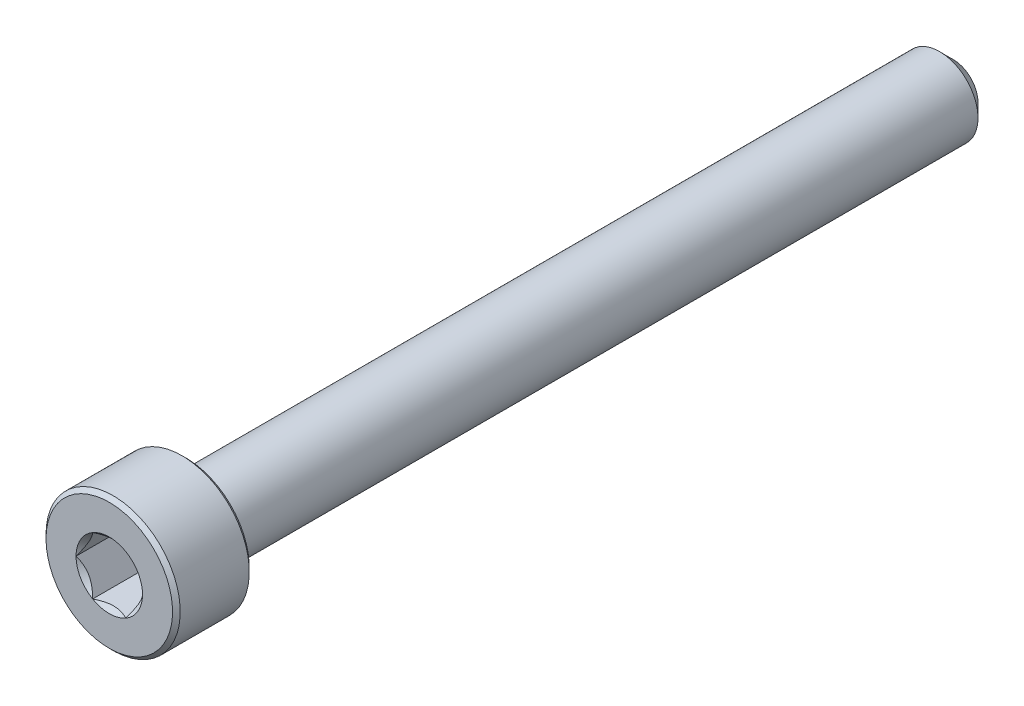
ISO-10303-21;
HEADER;
FILE_DESCRIPTION(('STEP AP214'),'2;1');
FILE_NAME('part.step','',(''),(''),'','','');
FILE_SCHEMA(('AUTOMOTIVE_DESIGN { 1 0 10303 214 1 1 1 1 }'));
ENDSEC;
DATA;
#1=APPLICATION_CONTEXT('core data for automotive mechanical design processes');
#2=APPLICATION_PROTOCOL_DEFINITION('international standard','automotive_design',2000,#1);
#3=PRODUCT_CONTEXT('',#1,'mechanical');
#4=PRODUCT('Part','Part','',(#3));
#5=PRODUCT_RELATED_PRODUCT_CATEGORY('part','',(#4));
#6=PRODUCT_DEFINITION_FORMATION('','',#4);
#7=PRODUCT_DEFINITION_CONTEXT('part definition',#1,'design');
#8=PRODUCT_DEFINITION('design','',#6,#7);
#9=PRODUCT_DEFINITION_SHAPE('','',#8);
#10=(LENGTH_UNIT() NAMED_UNIT(*) SI_UNIT(.MILLI.,.METRE.));
#11=(NAMED_UNIT(*) PLANE_ANGLE_UNIT() SI_UNIT($,.RADIAN.));
#12=(NAMED_UNIT(*) SI_UNIT($,.STERADIAN.) SOLID_ANGLE_UNIT());
#13=UNCERTAINTY_MEASURE_WITH_UNIT(LENGTH_MEASURE(1.E-05),#10,'distance_accuracy_value','');
#14=(GEOMETRIC_REPRESENTATION_CONTEXT(3) GLOBAL_UNCERTAINTY_ASSIGNED_CONTEXT((#13)) GLOBAL_UNIT_ASSIGNED_CONTEXT((#10,
#11,#12)) REPRESENTATION_CONTEXT('',''));
#15=CARTESIAN_POINT('',(0.,0.,0.));
#16=DIRECTION('',(0.,0.,1.));
#17=DIRECTION('',(1.,0.,0.));
#18=AXIS2_PLACEMENT_3D('',#15,#16,#17);
#19=CARTESIAN_POINT('',(0.,0.,22.));
#20=DIRECTION('',(0.,0.,1.));
#21=DIRECTION('',(1.,0.,0.));
#22=AXIS2_PLACEMENT_3D('',#19,#20,#21);
#23=PLANE('',#22);
#24=CARTESIAN_POINT('',(0.,0.,22.));
#25=DIRECTION('',(0.,0.,1.));
#26=DIRECTION('',(1.,0.,0.));
#27=AXIS2_PLACEMENT_3D('',#24,#25,#26);
#28=CIRCLE('',#27,1.73205080756888);
#29=CARTESIAN_POINT('',(1.73205080756888,0.,22.));
#30=VERTEX_POINT('',#29);
#31=CARTESIAN_POINT('',(0.866025403784439,1.5,22.));
#32=VERTEX_POINT('',#31);
#33=EDGE_CURVE('E105',#30,#32,#28,.T.);
#34=ORIENTED_EDGE('',*,*,#33,.F.);
#35=CARTESIAN_POINT('',(0.866025403784438,-1.5,22.));
#36=VERTEX_POINT('',#35);
#37=EDGE_CURVE('E95',#36,#30,#28,.T.);
#38=ORIENTED_EDGE('',*,*,#37,.F.);
#39=CARTESIAN_POINT('',(-0.866025403784438,-1.5,22.));
#40=VERTEX_POINT('',#39);
#41=EDGE_CURVE('E103',#40,#36,#28,.T.);
#42=ORIENTED_EDGE('',*,*,#41,.F.);
#43=CARTESIAN_POINT('',(-1.73205080756888,0.,22.));
#44=VERTEX_POINT('',#43);
#45=EDGE_CURVE('E267',#44,#40,#28,.T.);
#46=ORIENTED_EDGE('',*,*,#45,.F.);
#47=CARTESIAN_POINT('',(-0.866025403784438,1.5,22.));
#48=VERTEX_POINT('',#47);
#49=EDGE_CURVE('E127',#48,#44,#28,.T.);
#50=ORIENTED_EDGE('',*,*,#49,.F.);
#51=EDGE_CURVE('E126',#32,#48,#28,.T.);
#52=ORIENTED_EDGE('',*,*,#51,.F.);
#53=EDGE_LOOP('',(#34,#38,#42,#46,#50,#52));
#54=FACE_BOUND('',#53,.T.);
#55=CARTESIAN_POINT('',(0.,0.,22.));
#56=DIRECTION('',(0.,0.,-1.));
#57=DIRECTION('',(-1.,0.,0.));
#58=AXIS2_PLACEMENT_3D('',#55,#56,#57);
#59=CIRCLE('',#58,3.3);
#60=CARTESIAN_POINT('',(-3.3,0.,22.));
#61=VERTEX_POINT('',#60);
#62=EDGE_CURVE('E49',#61,#61,#59,.T.);
#63=ORIENTED_EDGE('',*,*,#62,.F.);
#64=EDGE_LOOP('',(#63));
#65=FACE_BOUND('',#64,.T.);
#66=ADVANCED_FACE('F36',(#54,#65),#23,.T.);
#67=CARTESIAN_POINT('',(0.,0.,21.8));
#68=DIRECTION('',(0.,0.,-1.));
#69=DIRECTION('',(-1.,0.,0.));
#70=AXIS2_PLACEMENT_3D('',#67,#68,#69);
#71=CONICAL_SURFACE('',#70,3.5,0.78539816339745);
#72=ORIENTED_EDGE('',*,*,#62,.T.);
#73=EDGE_LOOP('',(#72));
#74=FACE_BOUND('',#73,.T.);
#75=CARTESIAN_POINT('',(0.,0.,21.8));
#76=DIRECTION('',(0.,0.,-1.));
#77=DIRECTION('',(-1.,0.,0.));
#78=AXIS2_PLACEMENT_3D('',#75,#76,#77);
#79=CIRCLE('',#78,3.5);
#80=CARTESIAN_POINT('',(-3.5,0.,21.8));
#81=VERTEX_POINT('',#80);
#82=EDGE_CURVE('E221',#81,#81,#79,.T.);
#83=ORIENTED_EDGE('',*,*,#82,.F.);
#84=EDGE_LOOP('',(#83));
#85=FACE_BOUND('',#84,.T.);
#86=ADVANCED_FACE('F209',(#74,#85),#71,.T.);
#87=CARTESIAN_POINT('',(0.,0.,-22.));
#88=DIRECTION('',(0.,0.,-1.));
#89=DIRECTION('',(-1.,0.,0.));
#90=AXIS2_PLACEMENT_3D('',#87,#88,#89);
#91=CYLINDRICAL_SURFACE('',#90,3.5);
#92=ORIENTED_EDGE('',*,*,#82,.T.);
#93=EDGE_LOOP('',(#92));
#94=FACE_BOUND('',#93,.T.);
#95=CARTESIAN_POINT('',(0.,0.,18.2));
#96=DIRECTION('',(0.,0.,-1.));
#97=DIRECTION('',(-1.,0.,0.));
#98=AXIS2_PLACEMENT_3D('',#95,#96,#97);
#99=CIRCLE('',#98,3.5);
#100=CARTESIAN_POINT('',(-3.5,0.,18.2));
#101=VERTEX_POINT('',#100);
#102=EDGE_CURVE('E222',#101,#101,#99,.T.);
#103=ORIENTED_EDGE('',*,*,#102,.F.);
#104=EDGE_LOOP('',(#103));
#105=FACE_BOUND('',#104,.T.);
#106=ADVANCED_FACE('F206',(#94,#105),#91,.T.);
#107=CARTESIAN_POINT('',(0.,0.,18.));
#108=DIRECTION('',(0.,0.,1.));
#109=DIRECTION('',(1.,0.,0.));
#110=AXIS2_PLACEMENT_3D('',#107,#108,#109);
#111=CONICAL_SURFACE('',#110,3.3,0.785398163397454);
#112=ORIENTED_EDGE('',*,*,#102,.T.);
#113=EDGE_LOOP('',(#112));
#114=FACE_BOUND('',#113,.T.);
#115=CARTESIAN_POINT('',(0.,0.,18.));
#116=DIRECTION('',(0.,0.,-1.));
#117=DIRECTION('',(-1.,0.,0.));
#118=AXIS2_PLACEMENT_3D('',#115,#116,#117);
#119=CIRCLE('',#118,3.3);
#120=CARTESIAN_POINT('',(-3.3,0.,18.));
#121=VERTEX_POINT('',#120);
#122=EDGE_CURVE('E225',#121,#121,#119,.T.);
#123=ORIENTED_EDGE('',*,*,#122,.F.);
#124=EDGE_LOOP('',(#123));
#125=FACE_BOUND('',#124,.T.);
#126=ADVANCED_FACE('F202',(#114,#125),#111,.T.);
#127=CARTESIAN_POINT('',(0.,3.3,18.));
#128=DIRECTION('',(0.,0.,-1.));
#129=DIRECTION('',(-1.,0.,0.));
#130=AXIS2_PLACEMENT_3D('',#127,#128,#129);
#131=PLANE('',#130);
#132=ORIENTED_EDGE('',*,*,#122,.T.);
#133=EDGE_LOOP('',(#132));
#134=FACE_BOUND('',#133,.T.);
#135=CARTESIAN_POINT('',(0.,0.,18.));
#136=DIRECTION('',(0.,0.,-1.));
#137=DIRECTION('',(-1.,0.,0.));
#138=AXIS2_PLACEMENT_3D('',#135,#136,#137);
#139=CIRCLE('',#138,2.);
#140=CARTESIAN_POINT('',(-2.,0.,18.));
#141=VERTEX_POINT('',#140);
#142=EDGE_CURVE('E230',#141,#141,#139,.T.);
#143=ORIENTED_EDGE('',*,*,#142,.F.);
#144=EDGE_LOOP('',(#143));
#145=FACE_BOUND('',#144,.T.);
#146=ADVANCED_FACE('F198',(#134,#145),#131,.T.);
#147=CARTESIAN_POINT('',(0.,0.,-22.));
#148=DIRECTION('',(0.,0.,-1.));
#149=DIRECTION('',(-1.,0.,0.));
#150=AXIS2_PLACEMENT_3D('',#147,#148,#149);
#151=CYLINDRICAL_SURFACE('',#150,2.);
#152=ORIENTED_EDGE('',*,*,#142,.T.);
#153=EDGE_LOOP('',(#152));
#154=FACE_BOUND('',#153,.T.);
#155=CARTESIAN_POINT('',(0.,0.,-21.3));
#156=DIRECTION('',(0.,0.,-1.));
#157=DIRECTION('',(-1.,0.,0.));
#158=AXIS2_PLACEMENT_3D('',#155,#156,#157);
#159=CIRCLE('',#158,2.);
#160=CARTESIAN_POINT('',(-2.,0.,-21.3));
#161=VERTEX_POINT('',#160);
#162=EDGE_CURVE('E233',#161,#161,#159,.T.);
#163=ORIENTED_EDGE('',*,*,#162,.F.);
#164=EDGE_LOOP('',(#163));
#165=FACE_BOUND('',#164,.T.);
#166=ADVANCED_FACE('F194',(#154,#165),#151,.T.);
#167=CARTESIAN_POINT('',(0.,0.,-22.));
#168=DIRECTION('',(0.,0.,1.));
#169=DIRECTION('',(1.,0.,0.));
#170=AXIS2_PLACEMENT_3D('',#167,#168,#169);
#171=CONICAL_SURFACE('',#170,1.3,0.78539816339744);
#172=ORIENTED_EDGE('',*,*,#162,.T.);
#173=EDGE_LOOP('',(#172));
#174=FACE_BOUND('',#173,.T.);
#175=CARTESIAN_POINT('',(0.,0.,-22.));
#176=DIRECTION('',(0.,0.,-1.));
#177=DIRECTION('',(-1.,0.,0.));
#178=AXIS2_PLACEMENT_3D('',#175,#176,#177);
#179=CIRCLE('',#178,1.3);
#180=CARTESIAN_POINT('',(-1.3,0.,-22.));
#181=VERTEX_POINT('',#180);
#182=EDGE_CURVE('E236',#181,#181,#179,.T.);
#183=ORIENTED_EDGE('',*,*,#182,.F.);
#184=EDGE_LOOP('',(#183));
#185=FACE_BOUND('',#184,.T.);
#186=ADVANCED_FACE('F190',(#174,#185),#171,.T.);
#187=CARTESIAN_POINT('',(0.,1.3,-22.));
#188=DIRECTION('',(0.,0.,-1.));
#189=DIRECTION('',(-1.,0.,0.));
#190=AXIS2_PLACEMENT_3D('',#187,#188,#189);
#191=PLANE('',#190);
#192=ORIENTED_EDGE('',*,*,#182,.T.);
#193=EDGE_LOOP('',(#192));
#194=FACE_BOUND('',#193,.T.);
#195=ADVANCED_FACE('F187',(#194),#191,.T.);
#196=CARTESIAN_POINT('',(0.,0.,22.));
#197=DIRECTION('',(0.,0.,1.));
#198=DIRECTION('',(1.,0.,0.));
#199=AXIS2_PLACEMENT_3D('',#196,#197,#198);
#200=CONICAL_SURFACE('',#199,1.73205080756888,0.78539816339745);
#201=ORIENTED_EDGE('',*,*,#33,.T.);
#202=CARTESIAN_POINT('',(1.73216627762272,-0.000200000000000874,22.0001154816001));
#203=CARTESIAN_POINT('',(1.70239359975915,0.0513677907370746,21.9703654760673));
#204=CARTESIAN_POINT('',(1.67212305186355,0.1037979176652,21.9423624839103));
#205=CARTESIAN_POINT('',(1.61039789003619,0.210709034055596,21.8910892304401));
#206=CARTESIAN_POINT('',(1.57893740312614,0.265200195814661,21.8678475050444));
#207=CARTESIAN_POINT('',(1.51549879897987,0.375079081357249,21.8280337289922));
#208=CARTESIAN_POINT('',(1.4835368452681,0.4304388090952,21.8113615856709));
#209=CARTESIAN_POINT('',(1.41890915196211,0.542377257477152,21.7856744568181));
#210=CARTESIAN_POINT('',(1.38624538781118,0.59895255655301,21.7766402904789));
#211=CARTESIAN_POINT('',(1.32995210095299,0.696455389516443,21.7684890812268));
#212=CARTESIAN_POINT('',(1.30639533311124,0.737256908280468,21.7672822529892));
#213=CARTESIAN_POINT('',(1.25932335290193,0.81878796961586,21.7693140571623));
#214=CARTESIAN_POINT('',(1.23580815085313,0.859517494314632,21.7725536707483));
#215=CARTESIAN_POINT('',(1.18900414978426,0.940584402163418,21.783291985982));
#216=CARTESIAN_POINT('',(1.16571558211719,0.980921384598291,21.7907946530187));
#217=CARTESIAN_POINT('',(1.11952932016335,1.06091833691403,21.8096516119283));
#218=CARTESIAN_POINT('',(1.09663179808786,1.10057800851621,21.8210075570186));
#219=CARTESIAN_POINT('',(1.03798159809698,1.20216313477449,21.8547216475927));
#220=CARTESIAN_POINT('',(1.00259267147465,1.26345855370969,21.8796218490934));
#221=CARTESIAN_POINT('',(0.950557780604374,1.35358562846331,21.9216566532716));
#222=CARTESIAN_POINT('',(0.933410759677147,1.38328513990772,21.9364251535591));
#223=CARTESIAN_POINT('',(0.899432101996406,1.44213790138375,21.9673105659402));
#224=CARTESIAN_POINT('',(0.88260031928571,1.47129140422064,21.9834268341217));
#225=CARTESIAN_POINT('',(0.865909933730601,1.5002,22.0001154816001));
#226=B_SPLINE_CURVE_WITH_KNOTS('',3,(#202,#203,#204,#205,#206,#207,#208,#209,#210,#211,#212,
#213,#214,#215,#216,#217,#218,#219,#220,#221,#222,#223,#224,#225),.UNSPECIFIED.,.F.,.F.,(4,2,2,
2,2,2,2,2,2,2,2,4),(0.,0.199829143693305,0.40082298738239,0.598623720538183,0.795926240188893,
0.937113067959885,1.07833105577193,1.21968061668222,1.36109089931055,1.58570969637566,
1.69770705470964,1.80965120737194),.UNSPECIFIED.);
#227=EDGE_CURVE('E12',#30,#32,#226,.T.);
#228=ORIENTED_EDGE('',*,*,#227,.F.);
#229=EDGE_LOOP('',(#201,#228));
#230=FACE_BOUND('',#229,.T.);
#231=ADVANCED_FACE('F107',(#230),#200,.F.);
#232=ORIENTED_EDGE('',*,*,#37,.T.);
#233=CARTESIAN_POINT('',(0.8659099337306,-1.5002,22.0001154816001));
#234=CARTESIAN_POINT('',(0.895682611594165,-1.44863220926293,21.9703654760673));
#235=CARTESIAN_POINT('',(0.925953159489764,-1.3962020823348,21.9423624839103));
#236=CARTESIAN_POINT('',(0.987678321317123,-1.2892909659444,21.8910892304401));
#237=CARTESIAN_POINT('',(1.01913880822717,-1.23479980418534,21.8678475050444));
#238=CARTESIAN_POINT('',(1.08257741237344,-1.12492091864275,21.8280337289922));
#239=CARTESIAN_POINT('',(1.11453936608521,-1.0695611909048,21.8113615856709));
#240=CARTESIAN_POINT('',(1.1791670593912,-0.957622742522849,21.7856744568181));
#241=CARTESIAN_POINT('',(1.21183082354213,-0.901047443446991,21.7766402904789));
#242=CARTESIAN_POINT('',(1.26812411040032,-0.803544610483558,21.7684890812268));
#243=CARTESIAN_POINT('',(1.29168087824208,-0.762743091719533,21.7672822529892));
#244=CARTESIAN_POINT('',(1.33875285845138,-0.681212030384141,21.7693140571623));
#245=CARTESIAN_POINT('',(1.36226806050018,-0.640482505685369,21.7725536707483));
#246=CARTESIAN_POINT('',(1.40907206156905,-0.559415597836583,21.783291985982));
#247=CARTESIAN_POINT('',(1.43236062923612,-0.51907861540171,21.7907946530187));
#248=CARTESIAN_POINT('',(1.47854689118997,-0.439081663085968,21.8096516119283));
#249=CARTESIAN_POINT('',(1.50144441326545,-0.399421991483791,21.8210075570186));
#250=CARTESIAN_POINT('',(1.56009461325633,-0.297836865225514,21.8547216475927));
#251=CARTESIAN_POINT('',(1.59548353987866,-0.23654144629031,21.8796218490934));
#252=CARTESIAN_POINT('',(1.64751843074894,-0.146414371536685,21.9216566532716));
#253=CARTESIAN_POINT('',(1.66466545167617,-0.116714860092281,21.9364251535591));
#254=CARTESIAN_POINT('',(1.69864410935691,-0.0578620986162484,21.9673105659402));
#255=CARTESIAN_POINT('',(1.71547589206761,-0.0287085957793627,21.9834268341217));
#256=CARTESIAN_POINT('',(1.73216627762272,0.000199999999999534,22.0001154816001));
#257=B_SPLINE_CURVE_WITH_KNOTS('',3,(#233,#234,#235,#236,#237,#238,#239,#240,#241,#242,#243,
#244,#245,#246,#247,#248,#249,#250,#251,#252,#253,#254,#255,#256),.UNSPECIFIED.,.F.,.F.,(4,2,2,
2,2,2,2,2,2,2,2,4),(0.,0.199829143693305,0.40082298738239,0.598623720538183,0.795926240188891,
0.937113067959884,1.07833105577193,1.21968061668222,1.36109089931055,1.58570969637566,
1.69770705470964,1.80965120737194),.UNSPECIFIED.);
#258=EDGE_CURVE('E98',#36,#30,#257,.T.);
#259=ORIENTED_EDGE('',*,*,#258,.F.);
#260=EDGE_LOOP('',(#232,#259));
#261=FACE_BOUND('',#260,.T.);
#262=ADVANCED_FACE('F97',(#261),#200,.F.);
#263=ORIENTED_EDGE('',*,*,#41,.T.);
#264=CARTESIAN_POINT('',(-1.72720812969692,-1.5,22.5555785162708));
#265=CARTESIAN_POINT('',(-1.68515175699268,-1.5,22.5238299078574));
#266=CARTESIAN_POINT('',(-1.64286104748674,-1.5,22.4923925938074));
#267=CARTESIAN_POINT('',(-1.55771581035942,-1.5,22.4302690875564));
#268=CARTESIAN_POINT('',(-1.51486114386668,-1.5,22.3995830858922));
#269=CARTESIAN_POINT('',(-1.3846813415127,-1.5,22.3084071924272));
#270=CARTESIAN_POINT('',(-1.29637976071654,-1.5,22.2492883434268));
#271=CARTESIAN_POINT('',(-1.11121478730467,-1.5,22.1332309963165));
#272=CARTESIAN_POINT('',(-1.01415038238167,-1.5,22.076609558733));
#273=CARTESIAN_POINT('',(-0.815173408897603,-1.5,21.9730368812657));
#274=CARTESIAN_POINT('',(-0.713278669253283,-1.5,21.9260530415417));
#275=CARTESIAN_POINT('',(-0.56033377494311,-1.5,21.8685726684308));
#276=CARTESIAN_POINT('',(-0.511547982948041,-1.5,21.8520753877572));
#277=CARTESIAN_POINT('',(-0.412798620136866,-1.5,21.822997512927));
#278=CARTESIAN_POINT('',(-0.362834968437562,-1.5,21.810417188594));
#279=CARTESIAN_POINT('',(-0.262863235444983,-1.5,21.7900361941468));
#280=CARTESIAN_POINT('',(-0.212872113808024,-1.5,21.782153632746));
#281=CARTESIAN_POINT('',(-0.112355243569547,-1.5,21.771322063969));
#282=CARTESIAN_POINT('',(-0.0618295883726288,-1.5,21.7683722085243));
#283=CARTESIAN_POINT('',(0.0374291733323832,-1.5,21.7676248577248));
#284=CARTESIAN_POINT('',(0.0861609672002978,-1.5,21.7696447335581));
#285=CARTESIAN_POINT('',(0.183206937768826,-1.5,21.7783225528968));
#286=CARTESIAN_POINT('',(0.231521073438268,-1.5,21.7849809469685));
#287=CARTESIAN_POINT('',(0.328199853425435,-1.5,21.8026852441226));
#288=CARTESIAN_POINT('',(0.376550616310328,-1.5,21.813805811257));
#289=CARTESIAN_POINT('',(0.472195697125598,-1.5,21.8398434140487));
#290=CARTESIAN_POINT('',(0.51949010309274,-1.5,21.8547601320409));
#291=CARTESIAN_POINT('',(0.668391282696623,-1.5,21.9073352235961));
#292=CARTESIAN_POINT('',(0.767878709508551,-1.5,21.950981287472));
#293=CARTESIAN_POINT('',(0.962179866690722,-1.5,22.0480229945931));
#294=CARTESIAN_POINT('',(1.05697519961444,-1.5,22.1014536650895));
#295=CARTESIAN_POINT('',(1.23814273533383,-1.5,22.2116858520046));
#296=CARTESIAN_POINT('',(1.32469942181289,-1.5,22.2681879206986));
#297=CARTESIAN_POINT('',(1.45222331290673,-1.5,22.3555343015787));
#298=CARTESIAN_POINT('',(1.49418091978756,-1.5,22.38495775868));
#299=CARTESIAN_POINT('',(1.57752272931476,-1.5,22.4445828218305));
#300=CARTESIAN_POINT('',(1.61890708647354,-1.5,22.4747842116644));
#301=CARTESIAN_POINT('',(1.66005278019494,-1.5,22.5053081786095));
#302=B_SPLINE_CURVE_WITH_KNOTS('',3,(#264,#265,#266,#267,#268,#269,#270,#271,#272,#273,#274,
#275,#276,#277,#278,#279,#280,#281,#282,#283,#284,#285,#286,#287,#288,#289,#290,#291,#292,#293,
#294,#295,#296,#297,#298,#299,#300,#301),.UNSPECIFIED.,.F.,.F.,(4,2,2,2,2,2,2,2,2,2,2,2,2,2,2,2,
2,2,4),(0.,0.158079548982667,0.31619878099394,0.634850417346958,0.97169031136151,
1.30737131660667,1.46173961127089,1.61611853740677,1.76772101421409,1.91929742368538,
2.065387412096,2.21149159305544,2.36014984633872,2.50879566386709,2.83376031422673,
3.15991186985651,3.46985601802197,3.62358896039973,3.7772796264207),.UNSPECIFIED.);
#303=EDGE_CURVE('E116',#40,#36,#302,.T.);
#304=ORIENTED_EDGE('',*,*,#303,.F.);
#305=EDGE_LOOP('',(#263,#304));
#306=FACE_BOUND('',#305,.T.);
#307=ADVANCED_FACE('F273',(#306),#200,.F.);
#308=ORIENTED_EDGE('',*,*,#45,.T.);
#309=CARTESIAN_POINT('',(-1.73216627762272,0.000200000000000134,22.0001154816001));
#310=CARTESIAN_POINT('',(-1.70239359975915,-0.0513677907370754,21.9703654760673));
#311=CARTESIAN_POINT('',(-1.67212305186355,-0.103797917665201,21.9423624839103));
#312=CARTESIAN_POINT('',(-1.61039789003619,-0.210709034055597,21.8910892304401));
#313=CARTESIAN_POINT('',(-1.57893740312614,-0.265200195814662,21.8678475050444));
#314=CARTESIAN_POINT('',(-1.51549879897987,-0.37507908135725,21.8280337289922));
#315=CARTESIAN_POINT('',(-1.4835368452681,-0.430438809095201,21.8113615856709));
#316=CARTESIAN_POINT('',(-1.41890915196211,-0.542377257477152,21.7856744568181));
#317=CARTESIAN_POINT('',(-1.38624538781118,-0.59895255655301,21.7766402904789));
#318=CARTESIAN_POINT('',(-1.32995210095299,-0.696455389516442,21.7684890812268));
#319=CARTESIAN_POINT('',(-1.30639533311124,-0.737256908280468,21.7672822529892));
#320=CARTESIAN_POINT('',(-1.25932335290193,-0.818787969615859,21.7693140571623));
#321=CARTESIAN_POINT('',(-1.23580815085313,-0.859517494314631,21.7725536707483));
#322=CARTESIAN_POINT('',(-1.18900414978427,-0.940584402163417,21.783291985982));
#323=CARTESIAN_POINT('',(-1.16571558211719,-0.98092138459829,21.7907946530187));
#324=CARTESIAN_POINT('',(-1.11952932016335,-1.06091833691403,21.8096516119283));
#325=CARTESIAN_POINT('',(-1.09663179808786,-1.10057800851621,21.8210075570186));
#326=CARTESIAN_POINT('',(-1.03798159809698,-1.20216313477449,21.8547216475927));
#327=CARTESIAN_POINT('',(-1.00259267147465,-1.26345855370969,21.8796218490934));
#328=CARTESIAN_POINT('',(-0.950557780604374,-1.35358562846332,21.9216566532716));
#329=CARTESIAN_POINT('',(-0.933410759677147,-1.38328513990772,21.9364251535591));
#330=CARTESIAN_POINT('',(-0.899432101996406,-1.44213790138375,21.9673105659402));
#331=CARTESIAN_POINT('',(-0.88260031928571,-1.47129140422064,21.9834268341217));
#332=CARTESIAN_POINT('',(-0.865909933730601,-1.5002,22.0001154816001));
#333=B_SPLINE_CURVE_WITH_KNOTS('',3,(#309,#310,#311,#312,#313,#314,#315,#316,#317,#318,#319,
#320,#321,#322,#323,#324,#325,#326,#327,#328,#329,#330,#331,#332),.UNSPECIFIED.,.F.,.F.,(4,2,2,
2,2,2,2,2,2,2,2,4),(0.,0.199829143693306,0.40082298738239,0.598623720538183,0.795926240188891,
0.937113067959883,1.07833105577193,1.21968061668222,1.36109089931055,1.58570969637566,
1.69770705470964,1.80965120737194),.UNSPECIFIED.);
#334=EDGE_CURVE('E153',#44,#40,#333,.T.);
#335=ORIENTED_EDGE('',*,*,#334,.F.);
#336=EDGE_LOOP('',(#308,#335));
#337=FACE_BOUND('',#336,.T.);
#338=ADVANCED_FACE('F306',(#337),#200,.F.);
#339=ORIENTED_EDGE('',*,*,#49,.T.);
#340=CARTESIAN_POINT('',(-0.865909933730601,1.5002,22.0001154816001));
#341=CARTESIAN_POINT('',(-0.895682611594165,1.44863220926292,21.9703654760673));
#342=CARTESIAN_POINT('',(-0.925953159489764,1.3962020823348,21.9423624839103));
#343=CARTESIAN_POINT('',(-0.987678321317123,1.2892909659444,21.8910892304401));
#344=CARTESIAN_POINT('',(-1.01913880822717,1.23479980418534,21.8678475050444));
#345=CARTESIAN_POINT('',(-1.08257741237344,1.12492091864275,21.8280337289922));
#346=CARTESIAN_POINT('',(-1.11453936608521,1.0695611909048,21.8113615856709));
#347=CARTESIAN_POINT('',(-1.1791670593912,0.957622742522848,21.7856744568181));
#348=CARTESIAN_POINT('',(-1.21183082354213,0.90104744344699,21.7766402904789));
#349=CARTESIAN_POINT('',(-1.26812411040032,0.803544610483558,21.7684890812268));
#350=CARTESIAN_POINT('',(-1.29168087824208,0.762743091719533,21.7672822529892));
#351=CARTESIAN_POINT('',(-1.33875285845138,0.681212030384141,21.7693140571623));
#352=CARTESIAN_POINT('',(-1.36226806050018,0.640482505685369,21.7725536707483));
#353=CARTESIAN_POINT('',(-1.40907206156905,0.559415597836583,21.783291985982));
#354=CARTESIAN_POINT('',(-1.43236062923612,0.519078615401711,21.7907946530187));
#355=CARTESIAN_POINT('',(-1.47854689118997,0.439081663085968,21.8096516119283));
#356=CARTESIAN_POINT('',(-1.50144441326545,0.399421991483791,21.8210075570186));
#357=CARTESIAN_POINT('',(-1.56009461325633,0.297836865225514,21.8547216475927));
#358=CARTESIAN_POINT('',(-1.59548353987866,0.23654144629031,21.8796218490934));
#359=CARTESIAN_POINT('',(-1.64751843074894,0.146414371536686,21.9216566532716));
#360=CARTESIAN_POINT('',(-1.66466545167617,0.116714860092282,21.9364251535591));
#361=CARTESIAN_POINT('',(-1.69864410935691,0.0578620986162493,21.9673105659402));
#362=CARTESIAN_POINT('',(-1.71547589206761,0.0287085957793633,21.9834268341217));
#363=CARTESIAN_POINT('',(-1.73216627762272,-0.000199999999999435,22.0001154816001));
#364=B_SPLINE_CURVE_WITH_KNOTS('',3,(#340,#341,#342,#343,#344,#345,#346,#347,#348,#349,#350,
#351,#352,#353,#354,#355,#356,#357,#358,#359,#360,#361,#362,#363),.UNSPECIFIED.,.F.,.F.,(4,2,2,
2,2,2,2,2,2,2,2,4),(0.,0.199829143693305,0.40082298738239,0.598623720538183,0.795926240188891,
0.937113067959883,1.07833105577193,1.21968061668222,1.36109089931055,1.58570969637566,
1.69770705470964,1.80965120737194),.UNSPECIFIED.);
#365=EDGE_CURVE('E160',#48,#44,#364,.T.);
#366=ORIENTED_EDGE('',*,*,#365,.F.);
#367=EDGE_LOOP('',(#339,#366));
#368=FACE_BOUND('',#367,.T.);
#369=ADVANCED_FACE('F145',(#368),#200,.F.);
#370=ORIENTED_EDGE('',*,*,#51,.T.);
#371=CARTESIAN_POINT('',(-1.72720812969692,1.5,22.5555785162708));
#372=CARTESIAN_POINT('',(-1.68515175699267,1.5,22.5238299078574));
#373=CARTESIAN_POINT('',(-1.64286104748673,1.5,22.4923925938074));
#374=CARTESIAN_POINT('',(-1.55771581035942,1.5,22.4302690875564));
#375=CARTESIAN_POINT('',(-1.51486114386668,1.5,22.3995830858922));
#376=CARTESIAN_POINT('',(-1.3846813415127,1.5,22.3084071924272));
#377=CARTESIAN_POINT('',(-1.29637976071653,1.5,22.2492883434268));
#378=CARTESIAN_POINT('',(-1.11121478730467,1.5,22.1332309963165));
#379=CARTESIAN_POINT('',(-1.01415038238167,1.5,22.076609558733));
#380=CARTESIAN_POINT('',(-0.815173408897604,1.5,21.9730368812656));
#381=CARTESIAN_POINT('',(-0.713278669253283,1.5,21.9260530415417));
#382=CARTESIAN_POINT('',(-0.56033377494311,1.5,21.8685726684308));
#383=CARTESIAN_POINT('',(-0.511547982948041,1.5,21.8520753877572));
#384=CARTESIAN_POINT('',(-0.412798620136865,1.5,21.822997512927));
#385=CARTESIAN_POINT('',(-0.362834968437562,1.5,21.810417188594));
#386=CARTESIAN_POINT('',(-0.262863235444981,1.5,21.7900361941468));
#387=CARTESIAN_POINT('',(-0.212872113808021,1.5,21.782153632746));
#388=CARTESIAN_POINT('',(-0.112355243569543,1.5,21.771322063969));
#389=CARTESIAN_POINT('',(-0.0618295883726259,1.5,21.7683722085243));
#390=CARTESIAN_POINT('',(0.0374291733323862,1.5,21.7676248577248));
#391=CARTESIAN_POINT('',(0.0861609672003011,1.5,21.7696447335581));
#392=CARTESIAN_POINT('',(0.183206937768829,1.5,21.7783225528968));
#393=CARTESIAN_POINT('',(0.231521073438271,1.5,21.7849809469685));
#394=CARTESIAN_POINT('',(0.328199853425438,1.5,21.8026852441226));
#395=CARTESIAN_POINT('',(0.37655061631033,1.5,21.813805811257));
#396=CARTESIAN_POINT('',(0.4721956971256,1.5,21.8398434140487));
#397=CARTESIAN_POINT('',(0.519490103092741,1.5,21.8547601320409));
#398=CARTESIAN_POINT('',(0.668391282696625,1.5,21.9073352235961));
#399=CARTESIAN_POINT('',(0.767878709508554,1.5,21.950981287472));
#400=CARTESIAN_POINT('',(0.962179866690725,1.5,22.0480229945931));
#401=CARTESIAN_POINT('',(1.05697519961444,1.5,22.1014536650895));
#402=CARTESIAN_POINT('',(1.23814273533383,1.5,22.2116858520046));
#403=CARTESIAN_POINT('',(1.3246994218129,1.5,22.2681879206986));
#404=CARTESIAN_POINT('',(1.45222331290674,1.5,22.3555343015787));
#405=CARTESIAN_POINT('',(1.49418091978756,1.5,22.38495775868));
#406=CARTESIAN_POINT('',(1.57752272931476,1.5,22.4445828218305));
#407=CARTESIAN_POINT('',(1.61890708647354,1.5,22.4747842116644));
#408=CARTESIAN_POINT('',(1.66005278019494,1.5,22.5053081786095));
#409=B_SPLINE_CURVE_WITH_KNOTS('',3,(#371,#372,#373,#374,#375,#376,#377,#378,#379,#380,#381,
#382,#383,#384,#385,#386,#387,#388,#389,#390,#391,#392,#393,#394,#395,#396,#397,#398,#399,#400,
#401,#402,#403,#404,#405,#406,#407,#408),.UNSPECIFIED.,.F.,.F.,(4,2,2,2,2,2,2,2,2,2,2,2,2,2,2,2,
2,2,4),(0.,0.158079548982669,0.31619878099394,0.634850417346955,0.971690311361509,
1.30737131660667,1.46173961127088,1.61611853740677,1.76772101421409,1.91929742368538,
2.065387412096,2.21149159305544,2.36014984633872,2.50879566386709,2.83376031422673,
3.15991186985651,3.46985601802197,3.62358896039974,3.7772796264207),.UNSPECIFIED.);
#410=EDGE_CURVE('E55',#32,#48,#409,.F.);
#411=ORIENTED_EDGE('',*,*,#410,.F.);
#412=EDGE_LOOP('',(#370,#411));
#413=FACE_BOUND('',#412,.T.);
#414=ADVANCED_FACE('F141',(#413),#200,.F.);
#415=CARTESIAN_POINT('',(0.,3.3,19.));
#416=DIRECTION('',(0.,0.,-1.));
#417=DIRECTION('',(-1.,0.,0.));
#418=AXIS2_PLACEMENT_3D('',#415,#416,#417);
#419=PLANE('',#418);
#420=DIRECTION('',(-0.5,0.866025403784439,0.));
#421=VECTOR('',#420,1.);
#422=CARTESIAN_POINT('',(1.73205080756888,0.,19.));
#423=LINE('',#422,#421);
#424=CARTESIAN_POINT('',(1.73205080756888,0.,19.));
#425=VERTEX_POINT('',#424);
#426=CARTESIAN_POINT('',(0.866025403784438,1.5,19.));
#427=VERTEX_POINT('',#426);
#428=EDGE_CURVE('E120',#425,#427,#423,.T.);
#429=ORIENTED_EDGE('',*,*,#428,.T.);
#430=DIRECTION('',(-1.,0.,0.));
#431=VECTOR('',#430,1.);
#432=CARTESIAN_POINT('',(0.866025403784438,1.5,19.));
#433=LINE('',#432,#431);
#434=CARTESIAN_POINT('',(-0.866025403784439,1.5,19.));
#435=VERTEX_POINT('',#434);
#436=EDGE_CURVE('E245',#427,#435,#433,.T.);
#437=ORIENTED_EDGE('',*,*,#436,.T.);
#438=DIRECTION('',(-0.5,-0.866025403784438,0.));
#439=VECTOR('',#438,1.);
#440=CARTESIAN_POINT('',(-0.866025403784439,1.5,19.));
#441=LINE('',#440,#439);
#442=CARTESIAN_POINT('',(-1.73205080756888,0.,19.));
#443=VERTEX_POINT('',#442);
#444=EDGE_CURVE('E244',#435,#443,#441,.T.);
#445=ORIENTED_EDGE('',*,*,#444,.T.);
#446=DIRECTION('',(0.5,-0.866025403784439,0.));
#447=VECTOR('',#446,1.);
#448=CARTESIAN_POINT('',(-1.73205080756888,0.,19.));
#449=LINE('',#448,#447);
#450=CARTESIAN_POINT('',(-0.866025403784439,-1.5,19.));
#451=VERTEX_POINT('',#450);
#452=EDGE_CURVE('E249',#443,#451,#449,.T.);
#453=ORIENTED_EDGE('',*,*,#452,.T.);
#454=DIRECTION('',(1.,0.,0.));
#455=VECTOR('',#454,1.);
#456=CARTESIAN_POINT('',(-0.866025403784439,-1.5,19.));
#457=LINE('',#456,#455);
#458=CARTESIAN_POINT('',(0.866025403784438,-1.5,19.));
#459=VERTEX_POINT('',#458);
#460=EDGE_CURVE('E253',#451,#459,#457,.T.);
#461=ORIENTED_EDGE('',*,*,#460,.T.);
#462=DIRECTION('',(0.5,0.866025403784439,0.));
#463=VECTOR('',#462,1.);
#464=CARTESIAN_POINT('',(0.866025403784438,-1.5,19.));
#465=LINE('',#464,#463);
#466=EDGE_CURVE('E121',#459,#425,#465,.T.);
#467=ORIENTED_EDGE('',*,*,#466,.T.);
#468=EDGE_LOOP('',(#429,#437,#445,#453,#461,#467));
#469=FACE_BOUND('',#468,.T.);
#470=ADVANCED_FACE('F144',(#469),#419,.F.);
#471=CARTESIAN_POINT('',(1.73205080756888,0.,13.4174243050442));
#472=DIRECTION('',(0.866025403784439,0.5,0.));
#473=DIRECTION('',(-0.5,0.866025403784439,0.));
#474=AXIS2_PLACEMENT_3D('',#471,#472,#473);
#475=PLANE('',#474);
#476=DIRECTION('',(0.,0.,1.));
#477=VECTOR('',#476,1.);
#478=CARTESIAN_POINT('',(1.73205080756888,0.,13.4174243050442));
#479=LINE('',#478,#477);
#480=EDGE_CURVE('E114',#425,#30,#479,.T.);
#481=ORIENTED_EDGE('',*,*,#480,.T.);
#482=ORIENTED_EDGE('',*,*,#227,.T.);
#483=DIRECTION('',(0.,0.,1.));
#484=VECTOR('',#483,1.);
#485=CARTESIAN_POINT('',(0.866025403784438,1.5,13.4174243050442));
#486=LINE('',#485,#484);
#487=EDGE_CURVE('E239',#427,#32,#486,.T.);
#488=ORIENTED_EDGE('',*,*,#487,.F.);
#489=ORIENTED_EDGE('',*,*,#428,.F.);
#490=EDGE_LOOP('',(#481,#482,#488,#489));
#491=FACE_BOUND('',#490,.T.);
#492=ADVANCED_FACE('F118',(#491),#475,.F.);
#493=CARTESIAN_POINT('',(0.866025403784438,-1.5,13.4174243050442));
#494=DIRECTION('',(0.866025403784438,-0.5,0.));
#495=DIRECTION('',(0.5,0.866025403784439,0.));
#496=AXIS2_PLACEMENT_3D('',#493,#494,#495);
#497=PLANE('',#496);
#498=DIRECTION('',(0.,0.,1.));
#499=VECTOR('',#498,1.);
#500=CARTESIAN_POINT('',(0.866025403784438,-1.5,13.4174243050442));
#501=LINE('',#500,#499);
#502=EDGE_CURVE('E63',#459,#36,#501,.T.);
#503=ORIENTED_EDGE('',*,*,#502,.T.);
#504=ORIENTED_EDGE('',*,*,#258,.T.);
#505=ORIENTED_EDGE('',*,*,#480,.F.);
#506=ORIENTED_EDGE('',*,*,#466,.F.);
#507=EDGE_LOOP('',(#503,#504,#505,#506));
#508=FACE_BOUND('',#507,.T.);
#509=ADVANCED_FACE('F113',(#508),#497,.F.);
#510=CARTESIAN_POINT('',(-0.866025403784439,-1.5,13.4174243050442));
#511=DIRECTION('',(0.,-1.,0.));
#512=DIRECTION('',(1.,0.,0.));
#513=AXIS2_PLACEMENT_3D('',#510,#511,#512);
#514=PLANE('',#513);
#515=DIRECTION('',(0.,0.,1.));
#516=VECTOR('',#515,1.);
#517=CARTESIAN_POINT('',(-0.866025403784439,-1.5,13.4174243050442));
#518=LINE('',#517,#516);
#519=EDGE_CURVE('E250',#451,#40,#518,.T.);
#520=ORIENTED_EDGE('',*,*,#519,.T.);
#521=ORIENTED_EDGE('',*,*,#303,.T.);
#522=ORIENTED_EDGE('',*,*,#502,.F.);
#523=ORIENTED_EDGE('',*,*,#460,.F.);
#524=EDGE_LOOP('',(#520,#521,#522,#523));
#525=FACE_BOUND('',#524,.T.);
#526=ADVANCED_FACE('F278',(#525),#514,.F.);
#527=CARTESIAN_POINT('',(-1.73205080756888,0.,13.4174243050442));
#528=DIRECTION('',(-0.866025403784439,-0.5,0.));
#529=DIRECTION('',(0.5,-0.866025403784439,0.));
#530=AXIS2_PLACEMENT_3D('',#527,#528,#529);
#531=PLANE('',#530);
#532=DIRECTION('',(0.,0.,1.));
#533=VECTOR('',#532,1.);
#534=CARTESIAN_POINT('',(-1.73205080756888,0.,13.4174243050442));
#535=LINE('',#534,#533);
#536=EDGE_CURVE('E246',#443,#44,#535,.T.);
#537=ORIENTED_EDGE('',*,*,#536,.T.);
#538=ORIENTED_EDGE('',*,*,#334,.T.);
#539=ORIENTED_EDGE('',*,*,#519,.F.);
#540=ORIENTED_EDGE('',*,*,#452,.F.);
#541=EDGE_LOOP('',(#537,#538,#539,#540));
#542=FACE_BOUND('',#541,.T.);
#543=ADVANCED_FACE('F177',(#542),#531,.F.);
#544=CARTESIAN_POINT('',(-0.866025403784439,1.5,13.4174243050442));
#545=DIRECTION('',(-0.866025403784438,0.5,0.));
#546=DIRECTION('',(-0.5,-0.866025403784438,0.));
#547=AXIS2_PLACEMENT_3D('',#544,#545,#546);
#548=PLANE('',#547);
#549=DIRECTION('',(0.,0.,1.));
#550=VECTOR('',#549,1.);
#551=CARTESIAN_POINT('',(-0.866025403784439,1.5,13.4174243050442));
#552=LINE('',#551,#550);
#553=EDGE_CURVE('E241',#435,#48,#552,.T.);
#554=ORIENTED_EDGE('',*,*,#553,.T.);
#555=ORIENTED_EDGE('',*,*,#365,.T.);
#556=ORIENTED_EDGE('',*,*,#536,.F.);
#557=ORIENTED_EDGE('',*,*,#444,.F.);
#558=EDGE_LOOP('',(#554,#555,#556,#557));
#559=FACE_BOUND('',#558,.T.);
#560=ADVANCED_FACE('F173',(#559),#548,.F.);
#561=CARTESIAN_POINT('',(0.866025403784438,1.5,13.4174243050442));
#562=DIRECTION('',(0.,1.,0.));
#563=DIRECTION('',(0.,0.,1.));
#564=AXIS2_PLACEMENT_3D('',#561,#562,#563);
#565=PLANE('',#564);
#566=ORIENTED_EDGE('',*,*,#487,.T.);
#567=ORIENTED_EDGE('',*,*,#410,.T.);
#568=ORIENTED_EDGE('',*,*,#553,.F.);
#569=ORIENTED_EDGE('',*,*,#436,.F.);
#570=EDGE_LOOP('',(#566,#567,#568,#569));
#571=FACE_BOUND('',#570,.T.);
#572=ADVANCED_FACE('F176',(#571),#565,.F.);
#573=CLOSED_SHELL('',(#66,#86,#106,#126,#146,#166,#186,#195,#231,#262,#307,#338,#369,#414,#470,
#492,#509,#526,#543,#560,#572));
#574=MANIFOLD_SOLID_BREP('B2',#573);
#575=ADVANCED_BREP_SHAPE_REPRESENTATION('',(#18,#574),#14);
#576=SHAPE_DEFINITION_REPRESENTATION(#9,#575);
ENDSEC;
END-ISO-10303-21;
